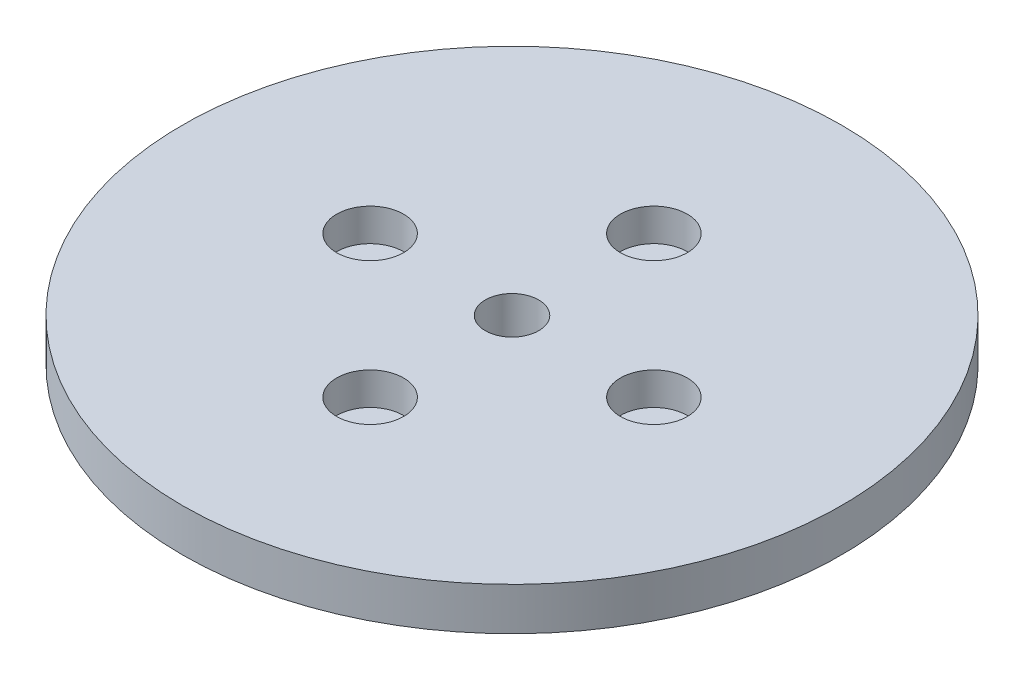
ISO-10303-21;
HEADER;
FILE_DESCRIPTION(('STEP AP214'),'2;1');
FILE_NAME('part.step','',(''),(''),'','','');
FILE_SCHEMA(('AUTOMOTIVE_DESIGN { 1 0 10303 214 1 1 1 1 }'));
ENDSEC;
DATA;
#1=APPLICATION_CONTEXT('core data for automotive mechanical design processes');
#2=APPLICATION_PROTOCOL_DEFINITION('international standard','automotive_design',2000,#1);
#3=PRODUCT_CONTEXT('',#1,'mechanical');
#4=PRODUCT('Part','Part','',(#3));
#5=PRODUCT_RELATED_PRODUCT_CATEGORY('part','',(#4));
#6=PRODUCT_DEFINITION_FORMATION('','',#4);
#7=PRODUCT_DEFINITION_CONTEXT('part definition',#1,'design');
#8=PRODUCT_DEFINITION('design','',#6,#7);
#9=PRODUCT_DEFINITION_SHAPE('','',#8);
#10=(LENGTH_UNIT() NAMED_UNIT(*) SI_UNIT(.MILLI.,.METRE.));
#11=(NAMED_UNIT(*) PLANE_ANGLE_UNIT() SI_UNIT($,.RADIAN.));
#12=(NAMED_UNIT(*) SI_UNIT($,.STERADIAN.) SOLID_ANGLE_UNIT());
#13=UNCERTAINTY_MEASURE_WITH_UNIT(LENGTH_MEASURE(1.E-05),#10,'distance_accuracy_value','');
#14=(GEOMETRIC_REPRESENTATION_CONTEXT(3) GLOBAL_UNCERTAINTY_ASSIGNED_CONTEXT((#13)) GLOBAL_UNIT_ASSIGNED_CONTEXT((#10,
#11,#12)) REPRESENTATION_CONTEXT('',''));
#15=CARTESIAN_POINT('',(0.,0.,0.));
#16=DIRECTION('',(0.,0.,1.));
#17=DIRECTION('',(1.,0.,0.));
#18=AXIS2_PLACEMENT_3D('',#15,#16,#17);
#19=CARTESIAN_POINT('',(0.,12.,0.));
#20=DIRECTION('',(0.,-1.,0.));
#21=DIRECTION('',(0.,0.,-1.));
#22=AXIS2_PLACEMENT_3D('',#19,#20,#21);
#23=CYLINDRICAL_SURFACE('',#22,92.5);
#24=CARTESIAN_POINT('',(0.,12.,0.));
#25=DIRECTION('',(0.,1.,0.));
#26=DIRECTION('',(0.,0.,1.));
#27=AXIS2_PLACEMENT_3D('',#24,#25,#26);
#28=CIRCLE('',#27,92.5);
#29=CARTESIAN_POINT('',(0.,12.,92.5));
#30=VERTEX_POINT('',#29);
#31=EDGE_CURVE('E10',#30,#30,#28,.T.);
#32=ORIENTED_EDGE('',*,*,#31,.F.);
#33=EDGE_LOOP('',(#32));
#34=FACE_BOUND('',#33,.T.);
#35=CARTESIAN_POINT('',(0.,0.,0.));
#36=DIRECTION('',(0.,1.,0.));
#37=DIRECTION('',(0.,0.,1.));
#38=AXIS2_PLACEMENT_3D('',#35,#36,#37);
#39=CIRCLE('',#38,92.5);
#40=CARTESIAN_POINT('',(0.,0.,92.5));
#41=VERTEX_POINT('',#40);
#42=EDGE_CURVE('E37',#41,#41,#39,.T.);
#43=ORIENTED_EDGE('',*,*,#42,.T.);
#44=EDGE_LOOP('',(#43));
#45=FACE_BOUND('',#44,.T.);
#46=ADVANCED_FACE('F40',(#34,#45),#23,.T.);
#47=CARTESIAN_POINT('',(0.,12.,0.));
#48=DIRECTION('',(0.,1.,0.));
#49=DIRECTION('',(0.,0.,1.));
#50=AXIS2_PLACEMENT_3D('',#47,#48,#49);
#51=PLANE('',#50);
#52=CARTESIAN_POINT('',(1.39028534306644E-13,12.,39.8193548279738));
#53=DIRECTION('',(0.,1.,0.));
#54=DIRECTION('',(1.,0.,0.));
#55=AXIS2_PLACEMENT_3D('',#52,#53,#54);
#56=CIRCLE('',#55,9.38836515850162);
#57=CARTESIAN_POINT('',(9.38836515850176,12.,39.8193548279738));
#58=VERTEX_POINT('',#57);
#59=EDGE_CURVE('E71',#58,#58,#56,.T.);
#60=ORIENTED_EDGE('',*,*,#59,.F.);
#61=EDGE_LOOP('',(#60));
#62=FACE_BOUND('',#61,.T.);
#63=CARTESIAN_POINT('',(39.8193548279738,12.,0.));
#64=DIRECTION('',(0.,1.,0.));
#65=DIRECTION('',(0.,0.,-1.));
#66=AXIS2_PLACEMENT_3D('',#63,#64,#65);
#67=CIRCLE('',#66,9.38836515850162);
#68=CARTESIAN_POINT('',(39.8193548279738,12.,-9.38836515850162));
#69=VERTEX_POINT('',#68);
#70=EDGE_CURVE('E70',#69,#69,#67,.T.);
#71=ORIENTED_EDGE('',*,*,#70,.F.);
#72=EDGE_LOOP('',(#71));
#73=FACE_BOUND('',#72,.T.);
#74=CARTESIAN_POINT('',(-4.17085602919932E-13,12.,-39.8193548279738));
#75=DIRECTION('',(0.,1.,0.));
#76=DIRECTION('',(-1.,0.,0.));
#77=AXIS2_PLACEMENT_3D('',#74,#75,#76);
#78=CIRCLE('',#77,9.38836515850162);
#79=CARTESIAN_POINT('',(-9.38836515850203,12.,-39.8193548279737));
#80=VERTEX_POINT('',#79);
#81=EDGE_CURVE('E61',#80,#80,#78,.T.);
#82=ORIENTED_EDGE('',*,*,#81,.F.);
#83=EDGE_LOOP('',(#82));
#84=FACE_BOUND('',#83,.T.);
#85=CARTESIAN_POINT('',(-39.8193548279738,12.,0.));
#86=DIRECTION('',(0.,1.,0.));
#87=DIRECTION('',(0.,0.,1.));
#88=AXIS2_PLACEMENT_3D('',#85,#86,#87);
#89=CIRCLE('',#88,9.38836515850162);
#90=CARTESIAN_POINT('',(-39.8193548279738,12.,9.38836515850162));
#91=VERTEX_POINT('',#90);
#92=EDGE_CURVE('E54',#91,#91,#89,.T.);
#93=ORIENTED_EDGE('',*,*,#92,.F.);
#94=EDGE_LOOP('',(#93));
#95=FACE_BOUND('',#94,.T.);
#96=CARTESIAN_POINT('',(0.,12.,0.));
#97=DIRECTION('',(0.,1.,0.));
#98=DIRECTION('',(0.,0.,1.));
#99=AXIS2_PLACEMENT_3D('',#96,#97,#98);
#100=CIRCLE('',#99,7.5);
#101=CARTESIAN_POINT('',(0.,12.,7.5));
#102=VERTEX_POINT('',#101);
#103=EDGE_CURVE('E50',#102,#102,#100,.T.);
#104=ORIENTED_EDGE('',*,*,#103,.F.);
#105=EDGE_LOOP('',(#104));
#106=FACE_BOUND('',#105,.T.);
#107=ORIENTED_EDGE('',*,*,#31,.T.);
#108=EDGE_LOOP('',(#107));
#109=FACE_BOUND('',#108,.T.);
#110=ADVANCED_FACE('F86',(#62,#73,#84,#95,#106,#109),#51,.T.);
#111=CARTESIAN_POINT('',(0.,0.,0.));
#112=DIRECTION('',(0.,1.,0.));
#113=DIRECTION('',(0.,0.,1.));
#114=AXIS2_PLACEMENT_3D('',#111,#112,#113);
#115=PLANE('',#114);
#116=CARTESIAN_POINT('',(0.,0.,0.));
#117=DIRECTION('',(0.,1.,0.));
#118=DIRECTION('',(0.,0.,1.));
#119=AXIS2_PLACEMENT_3D('',#116,#117,#118);
#120=CIRCLE('',#119,7.5);
#121=CARTESIAN_POINT('',(0.,0.,7.5));
#122=VERTEX_POINT('',#121);
#123=EDGE_CURVE('E47',#122,#122,#120,.T.);
#124=ORIENTED_EDGE('',*,*,#123,.T.);
#125=EDGE_LOOP('',(#124));
#126=FACE_BOUND('',#125,.T.);
#127=ORIENTED_EDGE('',*,*,#42,.F.);
#128=EDGE_LOOP('',(#127));
#129=FACE_BOUND('',#128,.T.);
#130=ADVANCED_FACE('F93',(#126,#129),#115,.F.);
#131=CARTESIAN_POINT('',(0.,12.,0.));
#132=DIRECTION('',(0.,-1.,0.));
#133=DIRECTION('',(0.,0.,-1.));
#134=AXIS2_PLACEMENT_3D('',#131,#132,#133);
#135=CYLINDRICAL_SURFACE('',#134,7.5);
#136=ORIENTED_EDGE('',*,*,#103,.T.);
#137=EDGE_LOOP('',(#136));
#138=FACE_BOUND('',#137,.T.);
#139=ORIENTED_EDGE('',*,*,#123,.F.);
#140=EDGE_LOOP('',(#139));
#141=FACE_BOUND('',#140,.T.);
#142=ADVANCED_FACE('F101',(#138,#141),#135,.F.);
#143=CARTESIAN_POINT('',(-39.8193548279738,2.87279918212053,0.));
#144=DIRECTION('',(0.,1.,0.));
#145=DIRECTION('',(0.,0.,1.));
#146=AXIS2_PLACEMENT_3D('',#143,#144,#145);
#147=CYLINDRICAL_SURFACE('',#146,9.38836515850162);
#148=CARTESIAN_POINT('',(-39.8193548279738,2.87279918212053,0.));
#149=DIRECTION('',(0.,1.,0.));
#150=DIRECTION('',(0.,0.,1.));
#151=AXIS2_PLACEMENT_3D('',#148,#149,#150);
#152=CIRCLE('',#151,9.38836515850162);
#153=CARTESIAN_POINT('',(-39.8193548279738,2.87279918212053,9.38836515850162));
#154=VERTEX_POINT('',#153);
#155=EDGE_CURVE('E55',#154,#154,#152,.T.);
#156=ORIENTED_EDGE('',*,*,#155,.F.);
#157=EDGE_LOOP('',(#156));
#158=FACE_BOUND('',#157,.T.);
#159=ORIENTED_EDGE('',*,*,#92,.T.);
#160=EDGE_LOOP('',(#159));
#161=FACE_BOUND('',#160,.T.);
#162=ADVANCED_FACE('F102',(#158,#161),#147,.F.);
#163=CARTESIAN_POINT('',(-39.8193548279738,2.87279918212053,0.));
#164=DIRECTION('',(0.,1.,0.));
#165=DIRECTION('',(0.,0.,1.));
#166=AXIS2_PLACEMENT_3D('',#163,#164,#165);
#167=PLANE('',#166);
#168=ORIENTED_EDGE('',*,*,#155,.T.);
#169=EDGE_LOOP('',(#168));
#170=FACE_BOUND('',#169,.T.);
#171=ADVANCED_FACE('F133',(#170),#167,.T.);
#172=CARTESIAN_POINT('',(-4.17085602919932E-13,2.87279918212053,-39.8193548279738));
#173=DIRECTION('',(0.,1.,0.));
#174=DIRECTION('',(0.,0.,1.));
#175=AXIS2_PLACEMENT_3D('',#172,#173,#174);
#176=CYLINDRICAL_SURFACE('',#175,9.38836515850162);
#177=CARTESIAN_POINT('',(-4.17085602919932E-13,2.87279918212053,-39.8193548279738));
#178=DIRECTION('',(0.,1.,0.));
#179=DIRECTION('',(-1.,0.,0.));
#180=AXIS2_PLACEMENT_3D('',#177,#178,#179);
#181=CIRCLE('',#180,9.38836515850162);
#182=CARTESIAN_POINT('',(-9.38836515850203,2.87279918212053,-39.8193548279737));
#183=VERTEX_POINT('',#182);
#184=EDGE_CURVE('E63',#183,#183,#181,.T.);
#185=ORIENTED_EDGE('',*,*,#184,.F.);
#186=EDGE_LOOP('',(#185));
#187=FACE_BOUND('',#186,.T.);
#188=ORIENTED_EDGE('',*,*,#81,.T.);
#189=EDGE_LOOP('',(#188));
#190=FACE_BOUND('',#189,.T.);
#191=ADVANCED_FACE('F142',(#187,#190),#176,.F.);
#192=CARTESIAN_POINT('',(-4.17085602919932E-13,2.87279918212053,-39.8193548279738));
#193=DIRECTION('',(0.,1.,0.));
#194=DIRECTION('',(-1.,0.,0.));
#195=AXIS2_PLACEMENT_3D('',#192,#193,#194);
#196=PLANE('',#195);
#197=ORIENTED_EDGE('',*,*,#184,.T.);
#198=EDGE_LOOP('',(#197));
#199=FACE_BOUND('',#198,.T.);
#200=ADVANCED_FACE('F156',(#199),#196,.T.);
#201=CARTESIAN_POINT('',(39.8193548279738,2.87279918212053,0.));
#202=DIRECTION('',(0.,1.,0.));
#203=DIRECTION('',(0.,0.,1.));
#204=AXIS2_PLACEMENT_3D('',#201,#202,#203);
#205=CYLINDRICAL_SURFACE('',#204,9.38836515850162);
#206=CARTESIAN_POINT('',(39.8193548279738,2.87279918212053,0.));
#207=DIRECTION('',(0.,1.,0.));
#208=DIRECTION('',(0.,0.,-1.));
#209=AXIS2_PLACEMENT_3D('',#206,#207,#208);
#210=CIRCLE('',#209,9.38836515850162);
#211=CARTESIAN_POINT('',(39.8193548279738,2.87279918212053,-9.38836515850162));
#212=VERTEX_POINT('',#211);
#213=EDGE_CURVE('E69',#212,#212,#210,.T.);
#214=ORIENTED_EDGE('',*,*,#213,.F.);
#215=EDGE_LOOP('',(#214));
#216=FACE_BOUND('',#215,.T.);
#217=ORIENTED_EDGE('',*,*,#70,.T.);
#218=EDGE_LOOP('',(#217));
#219=FACE_BOUND('',#218,.T.);
#220=ADVANCED_FACE('F164',(#216,#219),#205,.F.);
#221=CARTESIAN_POINT('',(39.8193548279738,2.87279918212053,0.));
#222=DIRECTION('',(0.,1.,0.));
#223=DIRECTION('',(0.,0.,-1.));
#224=AXIS2_PLACEMENT_3D('',#221,#222,#223);
#225=PLANE('',#224);
#226=ORIENTED_EDGE('',*,*,#213,.T.);
#227=EDGE_LOOP('',(#226));
#228=FACE_BOUND('',#227,.T.);
#229=ADVANCED_FACE('F83',(#228),#225,.T.);
#230=CARTESIAN_POINT('',(1.39028534306644E-13,2.87279918212053,39.8193548279738));
#231=DIRECTION('',(0.,1.,0.));
#232=DIRECTION('',(0.,0.,1.));
#233=AXIS2_PLACEMENT_3D('',#230,#231,#232);
#234=CYLINDRICAL_SURFACE('',#233,9.38836515850162);
#235=CARTESIAN_POINT('',(1.39028534306644E-13,2.87279918212053,39.8193548279738));
#236=DIRECTION('',(0.,1.,0.));
#237=DIRECTION('',(1.,0.,0.));
#238=AXIS2_PLACEMENT_3D('',#235,#236,#237);
#239=CIRCLE('',#238,9.38836515850162);
#240=CARTESIAN_POINT('',(9.38836515850176,2.87279918212053,39.8193548279738));
#241=VERTEX_POINT('',#240);
#242=EDGE_CURVE('E59',#241,#241,#239,.T.);
#243=ORIENTED_EDGE('',*,*,#242,.F.);
#244=EDGE_LOOP('',(#243));
#245=FACE_BOUND('',#244,.T.);
#246=ORIENTED_EDGE('',*,*,#59,.T.);
#247=EDGE_LOOP('',(#246));
#248=FACE_BOUND('',#247,.T.);
#249=ADVANCED_FACE('F81',(#245,#248),#234,.F.);
#250=CARTESIAN_POINT('',(1.39028534306644E-13,2.87279918212053,39.8193548279738));
#251=DIRECTION('',(0.,1.,0.));
#252=DIRECTION('',(1.,0.,0.));
#253=AXIS2_PLACEMENT_3D('',#250,#251,#252);
#254=PLANE('',#253);
#255=ORIENTED_EDGE('',*,*,#242,.T.);
#256=EDGE_LOOP('',(#255));
#257=FACE_BOUND('',#256,.T.);
#258=ADVANCED_FACE('F78',(#257),#254,.T.);
#259=CLOSED_SHELL('',(#46,#110,#130,#142,#162,#171,#191,#200,#220,#229,#249,#258));
#260=MANIFOLD_SOLID_BREP('B2',#259);
#261=ADVANCED_BREP_SHAPE_REPRESENTATION('',(#18,#260),#14);
#262=SHAPE_DEFINITION_REPRESENTATION(#9,#261);
ENDSEC;
END-ISO-10303-21;
